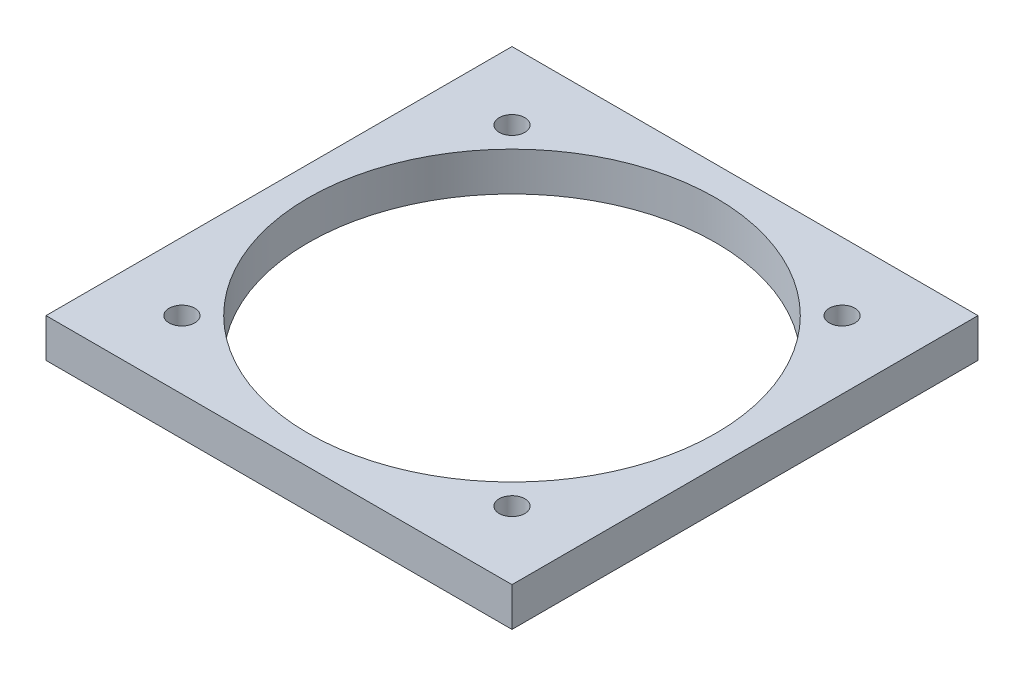
ISO-10303-21;
HEADER;
FILE_DESCRIPTION(('STEP AP214'),'2;1');
FILE_NAME('part.step','',(''),(''),'','','');
FILE_SCHEMA(('AUTOMOTIVE_DESIGN { 1 0 10303 214 1 1 1 1 }'));
ENDSEC;
DATA;
#1=APPLICATION_CONTEXT('core data for automotive mechanical design processes');
#2=APPLICATION_PROTOCOL_DEFINITION('international standard','automotive_design',2000,#1);
#3=PRODUCT_CONTEXT('',#1,'mechanical');
#4=PRODUCT('Part','Part','',(#3));
#5=PRODUCT_RELATED_PRODUCT_CATEGORY('part','',(#4));
#6=PRODUCT_DEFINITION_FORMATION('','',#4);
#7=PRODUCT_DEFINITION_CONTEXT('part definition',#1,'design');
#8=PRODUCT_DEFINITION('design','',#6,#7);
#9=PRODUCT_DEFINITION_SHAPE('','',#8);
#10=(LENGTH_UNIT() NAMED_UNIT(*) SI_UNIT(.MILLI.,.METRE.));
#11=(NAMED_UNIT(*) PLANE_ANGLE_UNIT() SI_UNIT($,.RADIAN.));
#12=(NAMED_UNIT(*) SI_UNIT($,.STERADIAN.) SOLID_ANGLE_UNIT());
#13=UNCERTAINTY_MEASURE_WITH_UNIT(LENGTH_MEASURE(1.E-05),#10,'distance_accuracy_value','');
#14=(GEOMETRIC_REPRESENTATION_CONTEXT(3) GLOBAL_UNCERTAINTY_ASSIGNED_CONTEXT((#13)) GLOBAL_UNIT_ASSIGNED_CONTEXT((#10,
#11,#12)) REPRESENTATION_CONTEXT('',''));
#15=CARTESIAN_POINT('',(0.,0.,0.));
#16=DIRECTION('',(0.,0.,1.));
#17=DIRECTION('',(1.,0.,0.));
#18=AXIS2_PLACEMENT_3D('',#15,#16,#17);
#19=CARTESIAN_POINT('',(0.,6.35,-38.1));
#20=DIRECTION('',(0.,0.,1.));
#21=DIRECTION('',(1.,0.,0.));
#22=AXIS2_PLACEMENT_3D('',#19,#20,#21);
#23=PLANE('',#22);
#24=DIRECTION('',(-1.,0.,0.));
#25=VECTOR('',#24,1.);
#26=CARTESIAN_POINT('',(0.,0.,-38.1));
#27=LINE('',#26,#25);
#28=CARTESIAN_POINT('',(38.1,0.,-38.1));
#29=VERTEX_POINT('',#28);
#30=CARTESIAN_POINT('',(-38.1,0.,-38.1));
#31=VERTEX_POINT('',#30);
#32=EDGE_CURVE('E114',#29,#31,#27,.T.);
#33=ORIENTED_EDGE('',*,*,#32,.T.);
#34=DIRECTION('',(0.,-1.,0.));
#35=VECTOR('',#34,1.);
#36=CARTESIAN_POINT('',(-38.1,6.35,-38.1));
#37=LINE('',#36,#35);
#38=CARTESIAN_POINT('',(-38.1,6.35,-38.1));
#39=VERTEX_POINT('',#38);
#40=EDGE_CURVE('E11',#39,#31,#37,.T.);
#41=ORIENTED_EDGE('',*,*,#40,.F.);
#42=DIRECTION('',(-1.,0.,0.));
#43=VECTOR('',#42,1.);
#44=CARTESIAN_POINT('',(0.,6.35,-38.1));
#45=LINE('',#44,#43);
#46=CARTESIAN_POINT('',(38.1,6.35,-38.1));
#47=VERTEX_POINT('',#46);
#48=EDGE_CURVE('E85',#47,#39,#45,.T.);
#49=ORIENTED_EDGE('',*,*,#48,.F.);
#50=DIRECTION('',(0.,-1.,0.));
#51=VECTOR('',#50,1.);
#52=CARTESIAN_POINT('',(38.1,6.35,-38.1));
#53=LINE('',#52,#51);
#54=EDGE_CURVE('E52',#47,#29,#53,.T.);
#55=ORIENTED_EDGE('',*,*,#54,.T.);
#56=EDGE_LOOP('',(#33,#41,#49,#55));
#57=FACE_BOUND('',#56,.T.);
#58=ADVANCED_FACE('F35',(#57),#23,.F.);
#59=CARTESIAN_POINT('',(-38.1,6.35,0.));
#60=DIRECTION('',(1.,0.,0.));
#61=DIRECTION('',(0.,0.,-1.));
#62=AXIS2_PLACEMENT_3D('',#59,#60,#61);
#63=PLANE('',#62);
#64=DIRECTION('',(0.,0.,1.));
#65=VECTOR('',#64,1.);
#66=CARTESIAN_POINT('',(-38.1,0.,0.));
#67=LINE('',#66,#65);
#68=CARTESIAN_POINT('',(-38.1,0.,38.1));
#69=VERTEX_POINT('',#68);
#70=EDGE_CURVE('E90',#31,#69,#67,.T.);
#71=ORIENTED_EDGE('',*,*,#70,.T.);
#72=DIRECTION('',(0.,-1.,0.));
#73=VECTOR('',#72,1.);
#74=CARTESIAN_POINT('',(-38.1,6.35,38.1));
#75=LINE('',#74,#73);
#76=CARTESIAN_POINT('',(-38.1,6.35,38.1));
#77=VERTEX_POINT('',#76);
#78=EDGE_CURVE('E44',#77,#69,#75,.T.);
#79=ORIENTED_EDGE('',*,*,#78,.F.);
#80=DIRECTION('',(0.,0.,1.));
#81=VECTOR('',#80,1.);
#82=CARTESIAN_POINT('',(-38.1,6.35,0.));
#83=LINE('',#82,#81);
#84=EDGE_CURVE('E77',#39,#77,#83,.T.);
#85=ORIENTED_EDGE('',*,*,#84,.F.);
#86=ORIENTED_EDGE('',*,*,#40,.T.);
#87=EDGE_LOOP('',(#71,#79,#85,#86));
#88=FACE_BOUND('',#87,.T.);
#89=ADVANCED_FACE('F89',(#88),#63,.F.);
#90=CARTESIAN_POINT('',(0.,6.35,38.1));
#91=DIRECTION('',(0.,0.,1.));
#92=DIRECTION('',(1.,0.,0.));
#93=AXIS2_PLACEMENT_3D('',#90,#91,#92);
#94=PLANE('',#93);
#95=DIRECTION('',(-1.,0.,0.));
#96=VECTOR('',#95,1.);
#97=CARTESIAN_POINT('',(0.,0.,38.1));
#98=LINE('',#97,#96);
#99=CARTESIAN_POINT('',(38.1,0.,38.1));
#100=VERTEX_POINT('',#99);
#101=EDGE_CURVE('E117',#100,#69,#98,.T.);
#102=ORIENTED_EDGE('',*,*,#101,.F.);
#103=DIRECTION('',(0.,-1.,0.));
#104=VECTOR('',#103,1.);
#105=CARTESIAN_POINT('',(38.1,6.35,38.1));
#106=LINE('',#105,#104);
#107=CARTESIAN_POINT('',(38.1,6.35,38.1));
#108=VERTEX_POINT('',#107);
#109=EDGE_CURVE('E66',#108,#100,#106,.T.);
#110=ORIENTED_EDGE('',*,*,#109,.F.);
#111=DIRECTION('',(-1.,0.,0.));
#112=VECTOR('',#111,1.);
#113=CARTESIAN_POINT('',(0.,6.35,38.1));
#114=LINE('',#113,#112);
#115=EDGE_CURVE('E84',#108,#77,#114,.T.);
#116=ORIENTED_EDGE('',*,*,#115,.T.);
#117=ORIENTED_EDGE('',*,*,#78,.T.);
#118=EDGE_LOOP('',(#102,#110,#116,#117));
#119=FACE_BOUND('',#118,.T.);
#120=ADVANCED_FACE('F93',(#119),#94,.T.);
#121=CARTESIAN_POINT('',(-26.9875,6.35,26.9875));
#122=DIRECTION('',(0.,-1.,0.));
#123=DIRECTION('',(0.,0.,-1.));
#124=AXIS2_PLACEMENT_3D('',#121,#122,#123);
#125=CYLINDRICAL_SURFACE('',#124,2.0955);
#126=CARTESIAN_POINT('',(-26.9875,6.35,26.9875));
#127=DIRECTION('',(0.,1.,0.));
#128=DIRECTION('',(0.,0.,1.));
#129=AXIS2_PLACEMENT_3D('',#126,#127,#128);
#130=CIRCLE('',#129,2.0955);
#131=CARTESIAN_POINT('',(-26.9875,6.35,29.083));
#132=VERTEX_POINT('',#131);
#133=EDGE_CURVE('E139',#132,#132,#130,.T.);
#134=ORIENTED_EDGE('',*,*,#133,.T.);
#135=EDGE_LOOP('',(#134));
#136=FACE_BOUND('',#135,.T.);
#137=CARTESIAN_POINT('',(-26.9875,0.,26.9875));
#138=DIRECTION('',(0.,1.,0.));
#139=DIRECTION('',(0.,0.,1.));
#140=AXIS2_PLACEMENT_3D('',#137,#138,#139);
#141=CIRCLE('',#140,2.0955);
#142=CARTESIAN_POINT('',(-26.9875,0.,29.083));
#143=VERTEX_POINT('',#142);
#144=EDGE_CURVE('E111',#143,#143,#141,.T.);
#145=ORIENTED_EDGE('',*,*,#144,.F.);
#146=EDGE_LOOP('',(#145));
#147=FACE_BOUND('',#146,.T.);
#148=ADVANCED_FACE('F143',(#136,#147),#125,.F.);
#149=CARTESIAN_POINT('',(26.9875,6.35,-26.9875));
#150=DIRECTION('',(0.,-1.,0.));
#151=DIRECTION('',(0.,0.,-1.));
#152=AXIS2_PLACEMENT_3D('',#149,#150,#151);
#153=CYLINDRICAL_SURFACE('',#152,2.0955);
#154=CARTESIAN_POINT('',(26.9875,6.35,-26.9875));
#155=DIRECTION('',(0.,1.,0.));
#156=DIRECTION('',(0.,0.,1.));
#157=AXIS2_PLACEMENT_3D('',#154,#155,#156);
#158=CIRCLE('',#157,2.0955);
#159=CARTESIAN_POINT('',(26.9875,6.35,-24.892));
#160=VERTEX_POINT('',#159);
#161=EDGE_CURVE('E136',#160,#160,#158,.T.);
#162=ORIENTED_EDGE('',*,*,#161,.T.);
#163=EDGE_LOOP('',(#162));
#164=FACE_BOUND('',#163,.T.);
#165=CARTESIAN_POINT('',(26.9875,0.,-26.9875));
#166=DIRECTION('',(0.,1.,0.));
#167=DIRECTION('',(0.,0.,1.));
#168=AXIS2_PLACEMENT_3D('',#165,#166,#167);
#169=CIRCLE('',#168,2.0955);
#170=CARTESIAN_POINT('',(26.9875,0.,-24.892));
#171=VERTEX_POINT('',#170);
#172=EDGE_CURVE('E108',#171,#171,#169,.T.);
#173=ORIENTED_EDGE('',*,*,#172,.F.);
#174=EDGE_LOOP('',(#173));
#175=FACE_BOUND('',#174,.T.);
#176=ADVANCED_FACE('F169',(#164,#175),#153,.F.);
#177=CARTESIAN_POINT('',(-26.9875,6.35,-26.9875));
#178=DIRECTION('',(0.,-1.,0.));
#179=DIRECTION('',(0.,0.,-1.));
#180=AXIS2_PLACEMENT_3D('',#177,#178,#179);
#181=CYLINDRICAL_SURFACE('',#180,2.0955);
#182=CARTESIAN_POINT('',(-26.9875,6.35,-26.9875));
#183=DIRECTION('',(0.,1.,0.));
#184=DIRECTION('',(0.,0.,1.));
#185=AXIS2_PLACEMENT_3D('',#182,#183,#184);
#186=CIRCLE('',#185,2.0955);
#187=CARTESIAN_POINT('',(-26.9875,6.35,-24.892));
#188=VERTEX_POINT('',#187);
#189=EDGE_CURVE('E131',#188,#188,#186,.T.);
#190=ORIENTED_EDGE('',*,*,#189,.T.);
#191=EDGE_LOOP('',(#190));
#192=FACE_BOUND('',#191,.T.);
#193=CARTESIAN_POINT('',(-26.9875,0.,-26.9875));
#194=DIRECTION('',(0.,1.,0.));
#195=DIRECTION('',(0.,0.,1.));
#196=AXIS2_PLACEMENT_3D('',#193,#194,#195);
#197=CIRCLE('',#196,2.0955);
#198=CARTESIAN_POINT('',(-26.9875,0.,-24.892));
#199=VERTEX_POINT('',#198);
#200=EDGE_CURVE('E105',#199,#199,#197,.T.);
#201=ORIENTED_EDGE('',*,*,#200,.F.);
#202=EDGE_LOOP('',(#201));
#203=FACE_BOUND('',#202,.T.);
#204=ADVANCED_FACE('F172',(#192,#203),#181,.F.);
#205=CARTESIAN_POINT('',(0.,6.35,0.));
#206=DIRECTION('',(0.,-1.,0.));
#207=DIRECTION('',(0.,0.,-1.));
#208=AXIS2_PLACEMENT_3D('',#205,#206,#207);
#209=CYLINDRICAL_SURFACE('',#208,33.3375);
#210=CARTESIAN_POINT('',(0.,6.35,0.));
#211=DIRECTION('',(0.,1.,0.));
#212=DIRECTION('',(0.,0.,1.));
#213=AXIS2_PLACEMENT_3D('',#210,#211,#212);
#214=CIRCLE('',#213,33.3375);
#215=CARTESIAN_POINT('',(0.,6.35,33.3375));
#216=VERTEX_POINT('',#215);
#217=EDGE_CURVE('E126',#216,#216,#214,.T.);
#218=ORIENTED_EDGE('',*,*,#217,.T.);
#219=EDGE_LOOP('',(#218));
#220=FACE_BOUND('',#219,.T.);
#221=CARTESIAN_POINT('',(0.,0.,0.));
#222=DIRECTION('',(0.,1.,0.));
#223=DIRECTION('',(0.,0.,1.));
#224=AXIS2_PLACEMENT_3D('',#221,#222,#223);
#225=CIRCLE('',#224,33.3375);
#226=CARTESIAN_POINT('',(0.,0.,33.3375));
#227=VERTEX_POINT('',#226);
#228=EDGE_CURVE('E102',#227,#227,#225,.T.);
#229=ORIENTED_EDGE('',*,*,#228,.F.);
#230=EDGE_LOOP('',(#229));
#231=FACE_BOUND('',#230,.T.);
#232=ADVANCED_FACE('F175',(#220,#231),#209,.F.);
#233=CARTESIAN_POINT('',(26.9875,6.35,26.9875));
#234=DIRECTION('',(0.,-1.,0.));
#235=DIRECTION('',(0.,0.,-1.));
#236=AXIS2_PLACEMENT_3D('',#233,#234,#235);
#237=CYLINDRICAL_SURFACE('',#236,2.0955);
#238=CARTESIAN_POINT('',(26.9875,6.35,26.9875));
#239=DIRECTION('',(0.,1.,0.));
#240=DIRECTION('',(0.,0.,1.));
#241=AXIS2_PLACEMENT_3D('',#238,#239,#240);
#242=CIRCLE('',#241,2.0955);
#243=CARTESIAN_POINT('',(26.9875,6.35,29.083));
#244=VERTEX_POINT('',#243);
#245=EDGE_CURVE('E122',#244,#244,#242,.T.);
#246=ORIENTED_EDGE('',*,*,#245,.T.);
#247=EDGE_LOOP('',(#246));
#248=FACE_BOUND('',#247,.T.);
#249=CARTESIAN_POINT('',(26.9875,0.,26.9875));
#250=DIRECTION('',(0.,1.,0.));
#251=DIRECTION('',(0.,0.,1.));
#252=AXIS2_PLACEMENT_3D('',#249,#250,#251);
#253=CIRCLE('',#252,2.0955);
#254=CARTESIAN_POINT('',(26.9875,0.,29.083));
#255=VERTEX_POINT('',#254);
#256=EDGE_CURVE('E99',#255,#255,#253,.T.);
#257=ORIENTED_EDGE('',*,*,#256,.F.);
#258=EDGE_LOOP('',(#257));
#259=FACE_BOUND('',#258,.T.);
#260=ADVANCED_FACE('F37',(#248,#259),#237,.F.);
#261=CARTESIAN_POINT('',(38.1,6.35,0.));
#262=DIRECTION('',(1.,0.,0.));
#263=DIRECTION('',(0.,0.,-1.));
#264=AXIS2_PLACEMENT_3D('',#261,#262,#263);
#265=PLANE('',#264);
#266=DIRECTION('',(0.,0.,1.));
#267=VECTOR('',#266,1.);
#268=CARTESIAN_POINT('',(38.1,0.,0.));
#269=LINE('',#268,#267);
#270=EDGE_CURVE('E119',#29,#100,#269,.T.);
#271=ORIENTED_EDGE('',*,*,#270,.F.);
#272=ORIENTED_EDGE('',*,*,#54,.F.);
#273=DIRECTION('',(0.,0.,1.));
#274=VECTOR('',#273,1.);
#275=CARTESIAN_POINT('',(38.1,6.35,0.));
#276=LINE('',#275,#274);
#277=EDGE_CURVE('E94',#47,#108,#276,.T.);
#278=ORIENTED_EDGE('',*,*,#277,.T.);
#279=ORIENTED_EDGE('',*,*,#109,.T.);
#280=EDGE_LOOP('',(#271,#272,#278,#279));
#281=FACE_BOUND('',#280,.T.);
#282=ADVANCED_FACE('F148',(#281),#265,.T.);
#283=CARTESIAN_POINT('',(0.,6.35,0.));
#284=DIRECTION('',(0.,1.,0.));
#285=DIRECTION('',(0.,0.,1.));
#286=AXIS2_PLACEMENT_3D('',#283,#284,#285);
#287=PLANE('',#286);
#288=ORIENTED_EDGE('',*,*,#245,.F.);
#289=EDGE_LOOP('',(#288));
#290=FACE_BOUND('',#289,.T.);
#291=ORIENTED_EDGE('',*,*,#217,.F.);
#292=EDGE_LOOP('',(#291));
#293=FACE_BOUND('',#292,.T.);
#294=ORIENTED_EDGE('',*,*,#189,.F.);
#295=EDGE_LOOP('',(#294));
#296=FACE_BOUND('',#295,.T.);
#297=ORIENTED_EDGE('',*,*,#161,.F.);
#298=EDGE_LOOP('',(#297));
#299=FACE_BOUND('',#298,.T.);
#300=ORIENTED_EDGE('',*,*,#133,.F.);
#301=EDGE_LOOP('',(#300));
#302=FACE_BOUND('',#301,.T.);
#303=ORIENTED_EDGE('',*,*,#48,.T.);
#304=ORIENTED_EDGE('',*,*,#84,.T.);
#305=ORIENTED_EDGE('',*,*,#115,.F.);
#306=ORIENTED_EDGE('',*,*,#277,.F.);
#307=EDGE_LOOP('',(#303,#304,#305,#306));
#308=FACE_BOUND('',#307,.T.);
#309=ADVANCED_FACE('F81',(#290,#293,#296,#299,#302,#308),#287,.T.);
#310=CARTESIAN_POINT('',(0.,0.,0.));
#311=DIRECTION('',(0.,1.,0.));
#312=DIRECTION('',(0.,0.,1.));
#313=AXIS2_PLACEMENT_3D('',#310,#311,#312);
#314=PLANE('',#313);
#315=ORIENTED_EDGE('',*,*,#256,.T.);
#316=EDGE_LOOP('',(#315));
#317=FACE_BOUND('',#316,.T.);
#318=ORIENTED_EDGE('',*,*,#228,.T.);
#319=EDGE_LOOP('',(#318));
#320=FACE_BOUND('',#319,.T.);
#321=ORIENTED_EDGE('',*,*,#200,.T.);
#322=EDGE_LOOP('',(#321));
#323=FACE_BOUND('',#322,.T.);
#324=ORIENTED_EDGE('',*,*,#172,.T.);
#325=EDGE_LOOP('',(#324));
#326=FACE_BOUND('',#325,.T.);
#327=ORIENTED_EDGE('',*,*,#144,.T.);
#328=EDGE_LOOP('',(#327));
#329=FACE_BOUND('',#328,.T.);
#330=ORIENTED_EDGE('',*,*,#32,.F.);
#331=ORIENTED_EDGE('',*,*,#270,.T.);
#332=ORIENTED_EDGE('',*,*,#101,.T.);
#333=ORIENTED_EDGE('',*,*,#70,.F.);
#334=EDGE_LOOP('',(#330,#331,#332,#333));
#335=FACE_BOUND('',#334,.T.);
#336=ADVANCED_FACE('F147',(#317,#320,#323,#326,#329,#335),#314,.F.);
#337=CLOSED_SHELL('',(#58,#89,#120,#148,#176,#204,#232,#260,#282,#309,#336));
#338=MANIFOLD_SOLID_BREP('B2',#337);
#339=ADVANCED_BREP_SHAPE_REPRESENTATION('',(#18,#338),#14);
#340=SHAPE_DEFINITION_REPRESENTATION(#9,#339);
ENDSEC;
END-ISO-10303-21;
